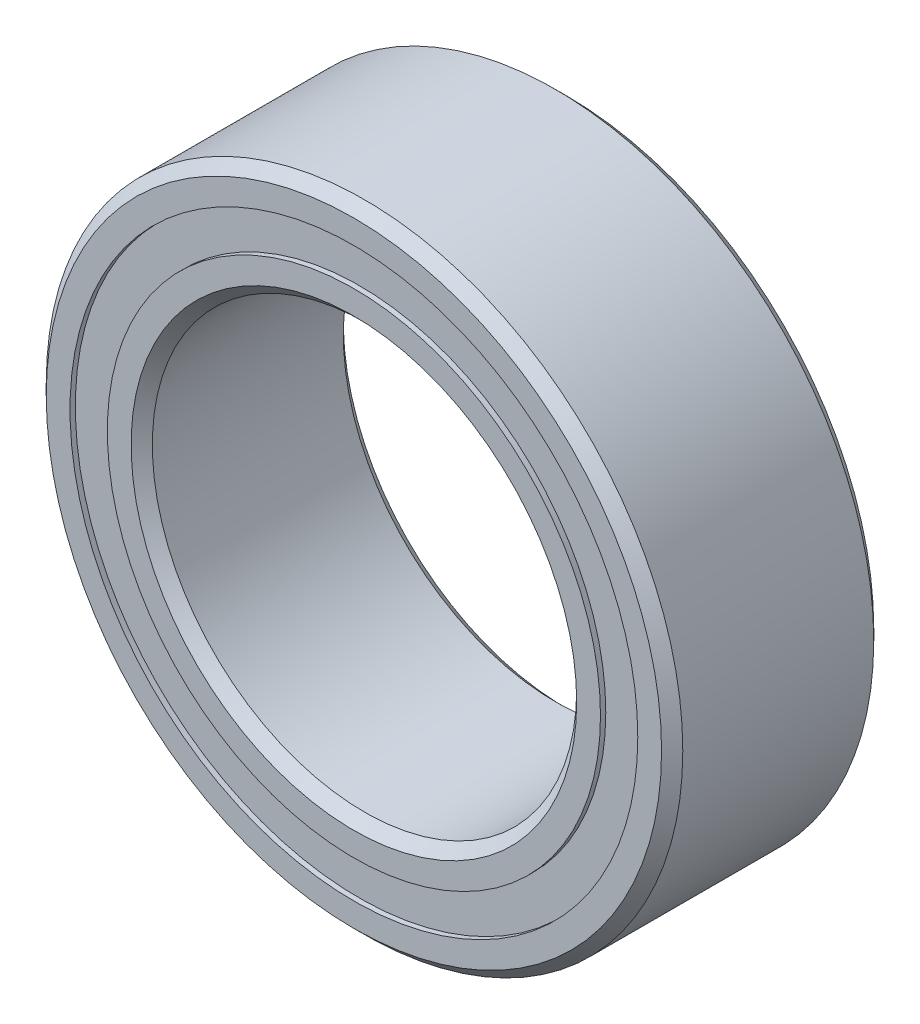
ISO-10303-21;
HEADER;
FILE_DESCRIPTION(('STEP AP214'),'2;1');
FILE_NAME('part.step','',(''),(''),'','','');
FILE_SCHEMA(('AUTOMOTIVE_DESIGN { 1 0 10303 214 1 1 1 1 }'));
ENDSEC;
DATA;
#1=APPLICATION_CONTEXT('core data for automotive mechanical design processes');
#2=APPLICATION_PROTOCOL_DEFINITION('international standard','automotive_design',2000,#1);
#3=PRODUCT_CONTEXT('',#1,'mechanical');
#4=PRODUCT('Part','Part','',(#3));
#5=PRODUCT_RELATED_PRODUCT_CATEGORY('part','',(#4));
#6=PRODUCT_DEFINITION_FORMATION('','',#4);
#7=PRODUCT_DEFINITION_CONTEXT('part definition',#1,'design');
#8=PRODUCT_DEFINITION('design','',#6,#7);
#9=PRODUCT_DEFINITION_SHAPE('','',#8);
#10=(LENGTH_UNIT() NAMED_UNIT(*) SI_UNIT(.MILLI.,.METRE.));
#11=(NAMED_UNIT(*) PLANE_ANGLE_UNIT() SI_UNIT($,.RADIAN.));
#12=(NAMED_UNIT(*) SI_UNIT($,.STERADIAN.) SOLID_ANGLE_UNIT());
#13=UNCERTAINTY_MEASURE_WITH_UNIT(LENGTH_MEASURE(1.E-05),#10,'distance_accuracy_value','');
#14=(GEOMETRIC_REPRESENTATION_CONTEXT(3) GLOBAL_UNCERTAINTY_ASSIGNED_CONTEXT((#13)) GLOBAL_UNIT_ASSIGNED_CONTEXT((#10,
#11,#12)) REPRESENTATION_CONTEXT('',''));
#15=CARTESIAN_POINT('',(0.,0.,0.));
#16=DIRECTION('',(0.,0.,1.));
#17=DIRECTION('',(1.,0.,0.));
#18=AXIS2_PLACEMENT_3D('',#15,#16,#17);
#19=CARTESIAN_POINT('',(0.,4.24787087912088,-1.508125));
#20=DIRECTION('',(0.,0.,1.));
#21=DIRECTION('',(1.,0.,0.));
#22=AXIS2_PLACEMENT_3D('',#19,#20,#21);
#23=PLANE('',#22);
#24=CARTESIAN_POINT('',(0.,0.,-1.508125));
#25=DIRECTION('',(0.,0.,1.));
#26=DIRECTION('',(1.,0.,0.));
#27=AXIS2_PLACEMENT_3D('',#24,#25,#26);
#28=CIRCLE('',#27,3.68962912087912);
#29=CARTESIAN_POINT('',(3.68962912087912,0.,-1.508125));
#30=VERTEX_POINT('',#29);
#31=EDGE_CURVE('P0_E18',#30,#30,#28,.T.);
#32=ORIENTED_EDGE('',*,*,#31,.T.);
#33=EDGE_LOOP('',(#32));
#34=FACE_BOUND('',#33,.T.);
#35=CARTESIAN_POINT('',(0.,0.,-1.508125));
#36=DIRECTION('',(0.,0.,1.));
#37=DIRECTION('',(1.,0.,0.));
#38=AXIS2_PLACEMENT_3D('',#35,#36,#37);
#39=CIRCLE('',#38,4.24787087912088);
#40=CARTESIAN_POINT('',(4.24787087912088,0.,-1.508125));
#41=VERTEX_POINT('',#40);
#42=EDGE_CURVE('P0_E27',#41,#41,#39,.T.);
#43=ORIENTED_EDGE('',*,*,#42,.F.);
#44=EDGE_LOOP('',(#43));
#45=FACE_BOUND('',#44,.T.);
#46=ADVANCED_FACE('P0_F15',(#34,#45),#23,.F.);
#47=CARTESIAN_POINT('',(0.,0.,1.5875));
#48=DIRECTION('',(0.,0.,1.));
#49=DIRECTION('',(1.,0.,0.));
#50=AXIS2_PLACEMENT_3D('',#47,#48,#49);
#51=CYLINDRICAL_SURFACE('',#50,3.68962912087912);
#52=ORIENTED_EDGE('',*,*,#31,.F.);
#53=EDGE_LOOP('',(#52));
#54=FACE_BOUND('',#53,.T.);
#55=CARTESIAN_POINT('',(0.,0.,-0.758760243513405));
#56=DIRECTION('',(0.,0.,1.));
#57=DIRECTION('',(1.,0.,0.));
#58=AXIS2_PLACEMENT_3D('',#55,#56,#57);
#59=CIRCLE('',#58,3.68962912087912);
#60=CARTESIAN_POINT('',(3.68962912087912,0.,-0.758760243513405));
#61=VERTEX_POINT('',#60);
#62=EDGE_CURVE('P0_E22',#61,#61,#59,.T.);
#63=ORIENTED_EDGE('',*,*,#62,.T.);
#64=EDGE_LOOP('',(#63));
#65=FACE_BOUND('',#64,.T.);
#66=ADVANCED_FACE('P0_F37',(#54,#65),#51,.F.);
#67=CARTESIAN_POINT('',(0.,0.,1.5875));
#68=DIRECTION('',(0.,0.,1.));
#69=DIRECTION('',(1.,0.,0.));
#70=AXIS2_PLACEMENT_3D('',#67,#68,#69);
#71=CYLINDRICAL_SURFACE('',#70,4.24787087912088);
#72=CARTESIAN_POINT('',(0.,0.,-0.758760243513404));
#73=DIRECTION('',(0.,0.,1.));
#74=DIRECTION('',(1.,0.,0.));
#75=AXIS2_PLACEMENT_3D('',#72,#73,#74);
#76=CIRCLE('',#75,4.24787087912088);
#77=CARTESIAN_POINT('',(4.24787087912088,0.,-0.758760243513404));
#78=VERTEX_POINT('',#77);
#79=EDGE_CURVE('P0_E10',#78,#78,#76,.F.);
#80=ORIENTED_EDGE('',*,*,#79,.T.);
#81=EDGE_LOOP('',(#80));
#82=FACE_BOUND('',#81,.T.);
#83=ORIENTED_EDGE('',*,*,#42,.T.);
#84=EDGE_LOOP('',(#83));
#85=FACE_BOUND('',#84,.T.);
#86=ADVANCED_FACE('P0_F40',(#82,#85),#71,.T.);
#87=CARTESIAN_POINT('',(0.,4.24787087912088,-0.758760243513404));
#88=DIRECTION('',(0.,0.,-1.));
#89=DIRECTION('',(-1.,0.,0.));
#90=AXIS2_PLACEMENT_3D('',#87,#88,#89);
#91=PLANE('',#90);
#92=ORIENTED_EDGE('',*,*,#79,.F.);
#93=EDGE_LOOP('',(#92));
#94=FACE_BOUND('',#93,.T.);
#95=ORIENTED_EDGE('',*,*,#62,.F.);
#96=EDGE_LOOP('',(#95));
#97=FACE_BOUND('',#96,.T.);
#98=ADVANCED_FACE('P0_F43',(#94,#97),#91,.F.);
#99=CLOSED_SHELL('',(#46,#66,#86,#98));
#100=MANIFOLD_SOLID_BREP('P0_B1',#99);
#101=CARTESIAN_POINT('',(-3.43703832126947,1.98437500000004,0.));
#102=DIRECTION('',(-0.866025403784433,0.50000000000001,0.));
#103=DIRECTION('',(0.,0.,-1.));
#104=AXIS2_PLACEMENT_3D('',#101,#102,#103);
#105=SPHERICAL_SURFACE('',#104,0.758760243513404);
#106=CARTESIAN_POINT('',(-2.7799326750052,1.60499487824333,0.));
#107=VERTEX_POINT('',#106);
#108=VERTEX_LOOP('',#107);
#109=FACE_BOUND('',#108,.T.);
#110=CARTESIAN_POINT('',(-4.09414396753374,2.36375512175675,0.));
#111=VERTEX_POINT('',#110);
#112=VERTEX_LOOP('',#111);
#113=FACE_BOUND('',#112,.T.);
#114=ADVANCED_FACE('P1_F16',(#109,#113),#105,.T.);
#115=CLOSED_SHELL('',(#114));
#116=MANIFOLD_SOLID_BREP('P1_B1',#115);
#117=CARTESIAN_POINT('',(3.43703832126948,-1.98437500000002,0.));
#118=DIRECTION('',(0.866025403784437,-0.500000000000004,0.));
#119=DIRECTION('',(0.,0.,-1.));
#120=AXIS2_PLACEMENT_3D('',#117,#118,#119);
#121=SPHERICAL_SURFACE('',#120,0.758760243513404);
#122=CARTESIAN_POINT('',(4.09414396753376,-2.36375512175672,0.));
#123=VERTEX_POINT('',#122);
#124=VERTEX_LOOP('',#123);
#125=FACE_BOUND('',#124,.T.);
#126=CARTESIAN_POINT('',(2.77993267500521,-1.60499487824331,0.));
#127=VERTEX_POINT('',#126);
#128=VERTEX_LOOP('',#127);
#129=FACE_BOUND('',#128,.T.);
#130=ADVANCED_FACE('P2_F16',(#125,#129),#121,.T.);
#131=CLOSED_SHELL('',(#130));
#132=MANIFOLD_SOLID_BREP('P2_B1',#131);
#133=CARTESIAN_POINT('',(1.984375,3.43703832126949,0.));
#134=DIRECTION('',(0.500000000000001,0.866025403784438,0.));
#135=DIRECTION('',(0.,0.,-1.));
#136=AXIS2_PLACEMENT_3D('',#133,#134,#135);
#137=SPHERICAL_SURFACE('',#136,0.758760243513404);
#138=CARTESIAN_POINT('',(2.36375512175671,4.09414396753376,0.));
#139=VERTEX_POINT('',#138);
#140=VERTEX_LOOP('',#139);
#141=FACE_BOUND('',#140,.T.);
#142=CARTESIAN_POINT('',(1.6049948782433,2.77993267500521,0.));
#143=VERTEX_POINT('',#142);
#144=VERTEX_LOOP('',#143);
#145=FACE_BOUND('',#144,.T.);
#146=ADVANCED_FACE('P3_F16',(#141,#145),#137,.T.);
#147=CLOSED_SHELL('',(#146));
#148=MANIFOLD_SOLID_BREP('P3_B1',#147);
#149=CARTESIAN_POINT('',(0.,-3.96875,0.));
#150=DIRECTION('',(0.,-1.,0.));
#151=DIRECTION('',(0.,0.,-1.));
#152=AXIS2_PLACEMENT_3D('',#149,#150,#151);
#153=SPHERICAL_SURFACE('',#152,0.758760243513404);
#154=CARTESIAN_POINT('',(0.,-3.2099897564866,0.));
#155=VERTEX_POINT('',#154);
#156=VERTEX_LOOP('',#155);
#157=FACE_BOUND('',#156,.T.);
#158=CARTESIAN_POINT('',(0.,-4.7275102435134,0.));
#159=VERTEX_POINT('',#158);
#160=VERTEX_LOOP('',#159);
#161=FACE_BOUND('',#160,.T.);
#162=ADVANCED_FACE('P4_F16',(#157,#161),#153,.T.);
#163=CLOSED_SHELL('',(#162));
#164=MANIFOLD_SOLID_BREP('P4_B1',#163);
#165=CARTESIAN_POINT('',(0.,0.,0.));
#166=DIRECTION('',(0.,0.,1.));
#167=DIRECTION('',(1.,0.,0.));
#168=AXIS2_PLACEMENT_3D('',#165,#166,#167);
#169=TOROIDAL_SURFACE('',#168,3.96875,0.758760243513403);
#170=CARTESIAN_POINT('',(0.,0.,0.705555555555556));
#171=DIRECTION('',(0.,0.,1.));
#172=DIRECTION('',(1.,0.,0.));
#173=AXIS2_PLACEMENT_3D('',#170,#171,#172);
#174=CIRCLE('',#173,3.68962912087912);
#175=CARTESIAN_POINT('',(3.68962912087912,0.,0.705555555555556));
#176=VERTEX_POINT('',#175);
#177=EDGE_CURVE('P5_E33',#176,#176,#174,.T.);
#178=ORIENTED_EDGE('',*,*,#177,.F.);
#179=EDGE_LOOP('',(#178));
#180=FACE_BOUND('',#179,.T.);
#181=CARTESIAN_POINT('',(0.,0.,-0.705555555555556));
#182=DIRECTION('',(0.,0.,1.));
#183=DIRECTION('',(1.,0.,0.));
#184=AXIS2_PLACEMENT_3D('',#181,#182,#183);
#185=CIRCLE('',#184,3.68962912087912);
#186=CARTESIAN_POINT('',(3.68962912087912,0.,-0.705555555555556));
#187=VERTEX_POINT('',#186);
#188=EDGE_CURVE('P5_E31',#187,#187,#185,.F.);
#189=ORIENTED_EDGE('',*,*,#188,.F.);
#190=EDGE_LOOP('',(#189));
#191=FACE_BOUND('',#190,.T.);
#192=ADVANCED_FACE('P5_F15',(#180,#191),#169,.F.);
#193=CARTESIAN_POINT('',(0.,0.,1.5875));
#194=DIRECTION('',(0.,0.,1.));
#195=DIRECTION('',(1.,0.,0.));
#196=AXIS2_PLACEMENT_3D('',#193,#194,#195);
#197=CYLINDRICAL_SURFACE('',#196,3.68962912087912);
#198=CARTESIAN_POINT('',(0.,0.,1.5875));
#199=DIRECTION('',(0.,0.,1.));
#200=DIRECTION('',(1.,0.,0.));
#201=AXIS2_PLACEMENT_3D('',#198,#199,#200);
#202=CIRCLE('',#201,3.68962912087912);
#203=CARTESIAN_POINT('',(3.68962912087912,0.,1.5875));
#204=VERTEX_POINT('',#203);
#205=EDGE_CURVE('P5_E19',#204,#204,#202,.F.);
#206=ORIENTED_EDGE('',*,*,#205,.T.);
#207=EDGE_LOOP('',(#206));
#208=FACE_BOUND('',#207,.T.);
#209=ORIENTED_EDGE('',*,*,#177,.T.);
#210=EDGE_LOOP('',(#209));
#211=FACE_BOUND('',#210,.T.);
#212=ADVANCED_FACE('P5_F49',(#208,#211),#197,.T.);
#213=CARTESIAN_POINT('',(0.,0.,1.5875));
#214=DIRECTION('',(0.,0.,1.));
#215=DIRECTION('',(1.,0.,0.));
#216=AXIS2_PLACEMENT_3D('',#213,#214,#215);
#217=CYLINDRICAL_SURFACE('',#216,3.68962912087912);
#218=ORIENTED_EDGE('',*,*,#188,.T.);
#219=EDGE_LOOP('',(#218));
#220=FACE_BOUND('',#219,.T.);
#221=CARTESIAN_POINT('',(0.,0.,-1.5875));
#222=DIRECTION('',(0.,0.,1.));
#223=DIRECTION('',(1.,0.,0.));
#224=AXIS2_PLACEMENT_3D('',#221,#222,#223);
#225=CIRCLE('',#224,3.68962912087912);
#226=CARTESIAN_POINT('',(3.68962912087912,0.,-1.5875));
#227=VERTEX_POINT('',#226);
#228=EDGE_CURVE('P5_E42',#227,#227,#225,.T.);
#229=ORIENTED_EDGE('',*,*,#228,.T.);
#230=EDGE_LOOP('',(#229));
#231=FACE_BOUND('',#230,.T.);
#232=ADVANCED_FACE('P5_F56',(#220,#231),#217,.T.);
#233=CARTESIAN_POINT('',(0.,3.68962912087912,1.5875));
#234=DIRECTION('',(0.,0.,-1.));
#235=DIRECTION('',(-1.,0.,0.));
#236=AXIS2_PLACEMENT_3D('',#233,#234,#235);
#237=PLANE('',#236);
#238=ORIENTED_EDGE('',*,*,#205,.F.);
#239=EDGE_LOOP('',(#238));
#240=FACE_BOUND('',#239,.T.);
#241=CARTESIAN_POINT('',(0.,0.,1.58749999997099));
#242=DIRECTION('',(0.,0.,1.));
#243=DIRECTION('',(1.,0.,0.));
#244=AXIS2_PLACEMENT_3D('',#241,#242,#243);
#245=CIRCLE('',#244,3.33374999996749);
#246=CARTESIAN_POINT('',(3.33374999996749,0.,1.58749999997099));
#247=VERTEX_POINT('',#246);
#248=EDGE_CURVE('P5_E40',#247,#247,#245,.F.);
#249=ORIENTED_EDGE('',*,*,#248,.T.);
#250=EDGE_LOOP('',(#249));
#251=FACE_BOUND('',#250,.T.);
#252=ADVANCED_FACE('P5_F52',(#240,#251),#237,.F.);
#253=CARTESIAN_POINT('',(0.,3.33375,-1.5875));
#254=DIRECTION('',(0.,0.,1.));
#255=DIRECTION('',(1.,0.,0.));
#256=AXIS2_PLACEMENT_3D('',#253,#254,#255);
#257=PLANE('',#256);
#258=CARTESIAN_POINT('',(0.,0.,-1.58749999997099));
#259=DIRECTION('',(0.,0.,-1.));
#260=DIRECTION('',(0.,1.,0.));
#261=AXIS2_PLACEMENT_3D('',#258,#259,#260);
#262=CIRCLE('',#261,3.33375000002434);
#263=CARTESIAN_POINT('',(0.,3.33375000002434,-1.58749999997099));
#264=VERTEX_POINT('',#263);
#265=EDGE_CURVE('P5_E28',#264,#264,#262,.F.);
#266=ORIENTED_EDGE('',*,*,#265,.T.);
#267=EDGE_LOOP('',(#266));
#268=FACE_BOUND('',#267,.T.);
#269=ORIENTED_EDGE('',*,*,#228,.F.);
#270=EDGE_LOOP('',(#269));
#271=FACE_BOUND('',#270,.T.);
#272=ADVANCED_FACE('P5_F55',(#268,#271),#257,.F.);
#273=CARTESIAN_POINT('',(0.,0.,1.58749999991414));
#274=DIRECTION('',(0.,0.,1.));
#275=DIRECTION('',(1.,0.,0.));
#276=AXIS2_PLACEMENT_3D('',#273,#274,#275);
#277=CONICAL_SURFACE('',#276,3.33374999991065,0.785398163397448);
#278=ORIENTED_EDGE('',*,*,#248,.F.);
#279=EDGE_LOOP('',(#278));
#280=FACE_BOUND('',#279,.T.);
#281=CARTESIAN_POINT('',(0.,0.,1.42875));
#282=DIRECTION('',(0.,0.,1.));
#283=DIRECTION('',(1.,0.,0.));
#284=AXIS2_PLACEMENT_3D('',#281,#282,#283);
#285=CIRCLE('',#284,3.175);
#286=CARTESIAN_POINT('',(3.175,0.,1.42875));
#287=VERTEX_POINT('',#286);
#288=EDGE_CURVE('P5_E23',#287,#287,#285,.F.);
#289=ORIENTED_EDGE('',*,*,#288,.T.);
#290=EDGE_LOOP('',(#289));
#291=FACE_BOUND('',#290,.T.);
#292=ADVANCED_FACE('P5_F60',(#280,#291),#277,.F.);
#293=CARTESIAN_POINT('',(0.,0.,-1.58749999997099));
#294=DIRECTION('',(0.,0.,-1.));
#295=DIRECTION('',(0.,1.,0.));
#296=AXIS2_PLACEMENT_3D('',#293,#294,#295);
#297=CONICAL_SURFACE('',#296,3.33375000002434,0.785398163397448);
#298=CARTESIAN_POINT('',(0.,0.,-1.42875));
#299=DIRECTION('',(0.,0.,1.));
#300=DIRECTION('',(1.,0.,0.));
#301=AXIS2_PLACEMENT_3D('',#298,#299,#300);
#302=CIRCLE('',#301,3.175);
#303=CARTESIAN_POINT('',(3.175,0.,-1.42875));
#304=VERTEX_POINT('',#303);
#305=EDGE_CURVE('P5_E10',#304,#304,#302,.T.);
#306=ORIENTED_EDGE('',*,*,#305,.T.);
#307=EDGE_LOOP('',(#306));
#308=FACE_BOUND('',#307,.T.);
#309=ORIENTED_EDGE('',*,*,#265,.F.);
#310=EDGE_LOOP('',(#309));
#311=FACE_BOUND('',#310,.T.);
#312=ADVANCED_FACE('P5_F63',(#308,#311),#297,.F.);
#313=CARTESIAN_POINT('',(0.,0.,1.5875));
#314=DIRECTION('',(0.,0.,1.));
#315=DIRECTION('',(1.,0.,0.));
#316=AXIS2_PLACEMENT_3D('',#313,#314,#315);
#317=CYLINDRICAL_SURFACE('',#316,3.175);
#318=ORIENTED_EDGE('',*,*,#288,.F.);
#319=EDGE_LOOP('',(#318));
#320=FACE_BOUND('',#319,.T.);
#321=ORIENTED_EDGE('',*,*,#305,.F.);
#322=EDGE_LOOP('',(#321));
#323=FACE_BOUND('',#322,.T.);
#324=ADVANCED_FACE('P5_F67',(#320,#323),#317,.F.);
#325=CLOSED_SHELL('',(#192,#212,#232,#252,#272,#292,#312,#324));
#326=MANIFOLD_SOLID_BREP('P5_B1',#325);
#327=CARTESIAN_POINT('',(0.,3.96875,0.));
#328=DIRECTION('',(0.,1.,0.));
#329=DIRECTION('',(0.,0.,-1.));
#330=AXIS2_PLACEMENT_3D('',#327,#328,#329);
#331=SPHERICAL_SURFACE('',#330,0.758760243513404);
#332=CARTESIAN_POINT('',(0.,3.2099897564866,0.));
#333=VERTEX_POINT('',#332);
#334=VERTEX_LOOP('',#333);
#335=FACE_BOUND('',#334,.T.);
#336=CARTESIAN_POINT('',(0.,4.7275102435134,0.));
#337=VERTEX_POINT('',#336);
#338=VERTEX_LOOP('',#337);
#339=FACE_BOUND('',#338,.T.);
#340=ADVANCED_FACE('P6_F16',(#335,#339),#331,.T.);
#341=CLOSED_SHELL('',(#340));
#342=MANIFOLD_SOLID_BREP('P6_B1',#341);
#343=CARTESIAN_POINT('',(1.98437499999998,-3.4370383212695,0.));
#344=DIRECTION('',(0.499999999999995,-0.866025403784442,0.));
#345=DIRECTION('',(0.,0.,-1.));
#346=AXIS2_PLACEMENT_3D('',#343,#344,#345);
#347=SPHERICAL_SURFACE('',#346,0.758760243513404);
#348=CARTESIAN_POINT('',(2.36375512175668,-4.09414396753378,0.));
#349=VERTEX_POINT('',#348);
#350=VERTEX_LOOP('',#349);
#351=FACE_BOUND('',#350,.T.);
#352=CARTESIAN_POINT('',(1.60499487824328,-2.77993267500523,0.));
#353=VERTEX_POINT('',#352);
#354=VERTEX_LOOP('',#353);
#355=FACE_BOUND('',#354,.T.);
#356=ADVANCED_FACE('P7_F16',(#351,#355),#347,.T.);
#357=CLOSED_SHELL('',(#356));
#358=MANIFOLD_SOLID_BREP('P7_B1',#357);
#359=CARTESIAN_POINT('',(-1.98437500000003,-3.43703832126947,0.));
#360=DIRECTION('',(-0.500000000000007,-0.866025403784435,0.));
#361=DIRECTION('',(0.,0.,-1.));
#362=AXIS2_PLACEMENT_3D('',#359,#360,#361);
#363=SPHERICAL_SURFACE('',#362,0.758760243513404);
#364=CARTESIAN_POINT('',(-1.60499487824332,-2.7799326750052,0.));
#365=VERTEX_POINT('',#364);
#366=VERTEX_LOOP('',#365);
#367=FACE_BOUND('',#366,.T.);
#368=CARTESIAN_POINT('',(-2.36375512175674,-4.09414396753375,0.));
#369=VERTEX_POINT('',#368);
#370=VERTEX_LOOP('',#369);
#371=FACE_BOUND('',#370,.T.);
#372=ADVANCED_FACE('P8_F16',(#367,#371),#363,.T.);
#373=CLOSED_SHELL('',(#372));
#374=MANIFOLD_SOLID_BREP('P8_B1',#373);
#375=CARTESIAN_POINT('',(-3.43703832126951,-1.98437499999997,0.));
#376=DIRECTION('',(-0.866025403784443,-0.499999999999992,0.));
#377=DIRECTION('',(0.,0.,-1.));
#378=AXIS2_PLACEMENT_3D('',#375,#376,#377);
#379=SPHERICAL_SURFACE('',#378,0.758760243513404);
#380=CARTESIAN_POINT('',(-4.09414396753379,-2.36375512175666,0.));
#381=VERTEX_POINT('',#380);
#382=VERTEX_LOOP('',#381);
#383=FACE_BOUND('',#382,.T.);
#384=CARTESIAN_POINT('',(-2.77993267500523,-1.60499487824327,0.));
#385=VERTEX_POINT('',#384);
#386=VERTEX_LOOP('',#385);
#387=FACE_BOUND('',#386,.T.);
#388=ADVANCED_FACE('P9_F16',(#383,#387),#379,.T.);
#389=CLOSED_SHELL('',(#388));
#390=MANIFOLD_SOLID_BREP('P9_B1',#389);
#391=CARTESIAN_POINT('',(-1.98437499999996,3.43703832126952,0.));
#392=DIRECTION('',(-0.499999999999989,0.866025403784445,0.));
#393=DIRECTION('',(0.,0.,-1.));
#394=AXIS2_PLACEMENT_3D('',#391,#392,#393);
#395=SPHERICAL_SURFACE('',#394,0.758760243513404);
#396=CARTESIAN_POINT('',(-2.36375512175665,4.0941439675338,0.));
#397=VERTEX_POINT('',#396);
#398=VERTEX_LOOP('',#397);
#399=FACE_BOUND('',#398,.T.);
#400=CARTESIAN_POINT('',(-1.60499487824326,2.77993267500524,0.));
#401=VERTEX_POINT('',#400);
#402=VERTEX_LOOP('',#401);
#403=FACE_BOUND('',#402,.T.);
#404=ADVANCED_FACE('P10_F16',(#399,#403),#395,.T.);
#405=CLOSED_SHELL('',(#404));
#406=MANIFOLD_SOLID_BREP('P10_B1',#405);
#407=CARTESIAN_POINT('',(3.4370383212695,1.98437499999999,0.));
#408=DIRECTION('',(0.86602540378444,0.499999999999998,0.));
#409=DIRECTION('',(0.,0.,-1.));
#410=AXIS2_PLACEMENT_3D('',#407,#408,#409);
#411=SPHERICAL_SURFACE('',#410,0.758760243513404);
#412=CARTESIAN_POINT('',(4.09414396753377,2.36375512175669,0.));
#413=VERTEX_POINT('',#412);
#414=VERTEX_LOOP('',#413);
#415=FACE_BOUND('',#414,.T.);
#416=CARTESIAN_POINT('',(2.77993267500522,1.60499487824329,0.));
#417=VERTEX_POINT('',#416);
#418=VERTEX_LOOP('',#417);
#419=FACE_BOUND('',#418,.T.);
#420=ADVANCED_FACE('P11_F16',(#415,#419),#411,.T.);
#421=CLOSED_SHELL('',(#420));
#422=MANIFOLD_SOLID_BREP('P11_B1',#421);
#423=CARTESIAN_POINT('',(-3.96875,0.,0.));
#424=DIRECTION('',(-1.,0.,0.));
#425=DIRECTION('',(0.,0.,-1.));
#426=AXIS2_PLACEMENT_3D('',#423,#424,#425);
#427=SPHERICAL_SURFACE('',#426,0.758760243513404);
#428=CARTESIAN_POINT('',(-4.7275102435134,0.,0.));
#429=VERTEX_POINT('',#428);
#430=VERTEX_LOOP('',#429);
#431=FACE_BOUND('',#430,.T.);
#432=CARTESIAN_POINT('',(-3.2099897564866,0.,0.));
#433=VERTEX_POINT('',#432);
#434=VERTEX_LOOP('',#433);
#435=FACE_BOUND('',#434,.T.);
#436=ADVANCED_FACE('P12_F16',(#431,#435),#427,.T.);
#437=CLOSED_SHELL('',(#436));
#438=MANIFOLD_SOLID_BREP('P12_B1',#437);
#439=CARTESIAN_POINT('',(3.96875,0.,0.));
#440=DIRECTION('',(1.,0.,0.));
#441=DIRECTION('',(0.,0.,-1.));
#442=AXIS2_PLACEMENT_3D('',#439,#440,#441);
#443=SPHERICAL_SURFACE('',#442,0.758760243513404);
#444=CARTESIAN_POINT('',(3.2099897564866,0.,0.));
#445=VERTEX_POINT('',#444);
#446=VERTEX_LOOP('',#445);
#447=FACE_BOUND('',#446,.T.);
#448=CARTESIAN_POINT('',(4.7275102435134,0.,0.));
#449=VERTEX_POINT('',#448);
#450=VERTEX_LOOP('',#449);
#451=FACE_BOUND('',#450,.T.);
#452=ADVANCED_FACE('P13_F16',(#447,#451),#443,.T.);
#453=CLOSED_SHELL('',(#452));
#454=MANIFOLD_SOLID_BREP('P13_B1',#453);
#455=CARTESIAN_POINT('',(0.,0.,0.));
#456=DIRECTION('',(0.,0.,1.));
#457=DIRECTION('',(1.,0.,0.));
#458=AXIS2_PLACEMENT_3D('',#455,#456,#457);
#459=TOROIDAL_SURFACE('',#458,3.96875,0.758760243513404);
#460=CARTESIAN_POINT('',(0.,0.,-0.705555555555556));
#461=DIRECTION('',(0.,0.,1.));
#462=DIRECTION('',(1.,0.,0.));
#463=AXIS2_PLACEMENT_3D('',#460,#461,#462);
#464=CIRCLE('',#463,4.24787087912088);
#465=CARTESIAN_POINT('',(4.24787087912088,0.,-0.705555555555556));
#466=VERTEX_POINT('',#465);
#467=EDGE_CURVE('P14_E33',#466,#466,#464,.F.);
#468=ORIENTED_EDGE('',*,*,#467,.T.);
#469=EDGE_LOOP('',(#468));
#470=FACE_BOUND('',#469,.T.);
#471=CARTESIAN_POINT('',(0.,0.,0.705555555555555));
#472=DIRECTION('',(0.,0.,1.));
#473=DIRECTION('',(1.,0.,0.));
#474=AXIS2_PLACEMENT_3D('',#471,#472,#473);
#475=CIRCLE('',#474,4.24787087912088);
#476=CARTESIAN_POINT('',(4.24787087912088,0.,0.705555555555555));
#477=VERTEX_POINT('',#476);
#478=EDGE_CURVE('P14_E31',#477,#477,#475,.T.);
#479=ORIENTED_EDGE('',*,*,#478,.T.);
#480=EDGE_LOOP('',(#479));
#481=FACE_BOUND('',#480,.T.);
#482=ADVANCED_FACE('P14_F15',(#470,#481),#459,.F.);
#483=CARTESIAN_POINT('',(0.,0.,1.5875));
#484=DIRECTION('',(0.,0.,1.));
#485=DIRECTION('',(1.,0.,0.));
#486=AXIS2_PLACEMENT_3D('',#483,#484,#485);
#487=CYLINDRICAL_SURFACE('',#486,4.24787087912088);
#488=CARTESIAN_POINT('',(0.,0.,-1.5875));
#489=DIRECTION('',(0.,0.,1.));
#490=DIRECTION('',(1.,0.,0.));
#491=AXIS2_PLACEMENT_3D('',#488,#489,#490);
#492=CIRCLE('',#491,4.24787087912088);
#493=CARTESIAN_POINT('',(4.24787087912088,0.,-1.5875));
#494=VERTEX_POINT('',#493);
#495=EDGE_CURVE('P14_E19',#494,#494,#492,.F.);
#496=ORIENTED_EDGE('',*,*,#495,.T.);
#497=EDGE_LOOP('',(#496));
#498=FACE_BOUND('',#497,.T.);
#499=ORIENTED_EDGE('',*,*,#467,.F.);
#500=EDGE_LOOP('',(#499));
#501=FACE_BOUND('',#500,.T.);
#502=ADVANCED_FACE('P14_F49',(#498,#501),#487,.F.);
#503=CARTESIAN_POINT('',(0.,0.,1.5875));
#504=DIRECTION('',(0.,0.,1.));
#505=DIRECTION('',(1.,0.,0.));
#506=AXIS2_PLACEMENT_3D('',#503,#504,#505);
#507=CYLINDRICAL_SURFACE('',#506,4.24787087912088);
#508=ORIENTED_EDGE('',*,*,#478,.F.);
#509=EDGE_LOOP('',(#508));
#510=FACE_BOUND('',#509,.T.);
#511=CARTESIAN_POINT('',(0.,0.,1.5875));
#512=DIRECTION('',(0.,0.,1.));
#513=DIRECTION('',(1.,0.,0.));
#514=AXIS2_PLACEMENT_3D('',#511,#512,#513);
#515=CIRCLE('',#514,4.24787087912088);
#516=CARTESIAN_POINT('',(4.24787087912088,0.,1.5875));
#517=VERTEX_POINT('',#516);
#518=EDGE_CURVE('P14_E42',#517,#517,#515,.T.);
#519=ORIENTED_EDGE('',*,*,#518,.T.);
#520=EDGE_LOOP('',(#519));
#521=FACE_BOUND('',#520,.T.);
#522=ADVANCED_FACE('P14_F56',(#510,#521),#507,.F.);
#523=CARTESIAN_POINT('',(0.,4.60375,-1.5875));
#524=DIRECTION('',(0.,0.,1.));
#525=DIRECTION('',(1.,0.,0.));
#526=AXIS2_PLACEMENT_3D('',#523,#524,#525);
#527=PLANE('',#526);
#528=ORIENTED_EDGE('',*,*,#495,.F.);
#529=EDGE_LOOP('',(#528));
#530=FACE_BOUND('',#529,.T.);
#531=CARTESIAN_POINT('',(0.,0.,-1.58750000002783));
#532=DIRECTION('',(0.,0.,1.));
#533=DIRECTION('',(1.,0.,0.));
#534=AXIS2_PLACEMENT_3D('',#531,#532,#533);
#535=CIRCLE('',#534,4.60375000000113);
#536=CARTESIAN_POINT('',(4.60375000000113,0.,-1.58750000002783));
#537=VERTEX_POINT('',#536);
#538=EDGE_CURVE('P14_E40',#537,#537,#535,.T.);
#539=ORIENTED_EDGE('',*,*,#538,.F.);
#540=EDGE_LOOP('',(#539));
#541=FACE_BOUND('',#540,.T.);
#542=ADVANCED_FACE('P14_F52',(#530,#541),#527,.F.);
#543=CARTESIAN_POINT('',(0.,4.60375,1.5875));
#544=DIRECTION('',(0.,0.,-1.));
#545=DIRECTION('',(-1.,0.,0.));
#546=AXIS2_PLACEMENT_3D('',#543,#544,#545);
#547=PLANE('',#546);
#548=CARTESIAN_POINT('',(0.,0.,1.58750000008467));
#549=DIRECTION('',(0.,0.,-1.));
#550=DIRECTION('',(-1.,0.,0.));
#551=AXIS2_PLACEMENT_3D('',#548,#549,#550);
#552=CIRCLE('',#551,4.60375000000113);
#553=CARTESIAN_POINT('',(-4.60375000000113,0.,1.58750000008467));
#554=VERTEX_POINT('',#553);
#555=EDGE_CURVE('P14_E28',#554,#554,#552,.T.);
#556=ORIENTED_EDGE('',*,*,#555,.F.);
#557=EDGE_LOOP('',(#556));
#558=FACE_BOUND('',#557,.T.);
#559=ORIENTED_EDGE('',*,*,#518,.F.);
#560=EDGE_LOOP('',(#559));
#561=FACE_BOUND('',#560,.T.);
#562=ADVANCED_FACE('P14_F55',(#558,#561),#547,.F.);
#563=CARTESIAN_POINT('',(0.,0.,-1.42874999994547));
#564=DIRECTION('',(0.,0.,1.));
#565=DIRECTION('',(1.,0.,0.));
#566=AXIS2_PLACEMENT_3D('',#563,#564,#565);
#567=CONICAL_SURFACE('',#566,4.76250000002665,0.785398163218414);
#568=CARTESIAN_POINT('',(0.,0.,-1.42875));
#569=DIRECTION('',(0.,0.,1.));
#570=DIRECTION('',(1.,0.,0.));
#571=AXIS2_PLACEMENT_3D('',#568,#569,#570);
#572=CIRCLE('',#571,4.7625);
#573=CARTESIAN_POINT('',(4.7625,0.,-1.42875));
#574=VERTEX_POINT('',#573);
#575=EDGE_CURVE('P14_E23',#574,#574,#572,.T.);
#576=ORIENTED_EDGE('',*,*,#575,.F.);
#577=EDGE_LOOP('',(#576));
#578=FACE_BOUND('',#577,.T.);
#579=ORIENTED_EDGE('',*,*,#538,.T.);
#580=EDGE_LOOP('',(#579));
#581=FACE_BOUND('',#580,.T.);
#582=ADVANCED_FACE('P14_F60',(#578,#581),#567,.T.);
#583=CARTESIAN_POINT('',(0.,0.,1.42875000005915));
#584=DIRECTION('',(0.,0.,-1.));
#585=DIRECTION('',(-1.,0.,0.));
#586=AXIS2_PLACEMENT_3D('',#583,#584,#585);
#587=CONICAL_SURFACE('',#586,4.7624999999698,0.785398163218414);
#588=CARTESIAN_POINT('',(0.,0.,1.42875));
#589=DIRECTION('',(0.,0.,1.));
#590=DIRECTION('',(1.,0.,0.));
#591=AXIS2_PLACEMENT_3D('',#588,#589,#590);
#592=CIRCLE('',#591,4.7625);
#593=CARTESIAN_POINT('',(4.7625,0.,1.42875));
#594=VERTEX_POINT('',#593);
#595=EDGE_CURVE('P14_E10',#594,#594,#592,.F.);
#596=ORIENTED_EDGE('',*,*,#595,.F.);
#597=EDGE_LOOP('',(#596));
#598=FACE_BOUND('',#597,.T.);
#599=ORIENTED_EDGE('',*,*,#555,.T.);
#600=EDGE_LOOP('',(#599));
#601=FACE_BOUND('',#600,.T.);
#602=ADVANCED_FACE('P14_F62',(#598,#601),#587,.T.);
#603=CARTESIAN_POINT('',(0.,0.,1.5875));
#604=DIRECTION('',(0.,0.,1.));
#605=DIRECTION('',(1.,0.,0.));
#606=AXIS2_PLACEMENT_3D('',#603,#604,#605);
#607=CYLINDRICAL_SURFACE('',#606,4.7625);
#608=ORIENTED_EDGE('',*,*,#595,.T.);
#609=EDGE_LOOP('',(#608));
#610=FACE_BOUND('',#609,.T.);
#611=ORIENTED_EDGE('',*,*,#575,.T.);
#612=EDGE_LOOP('',(#611));
#613=FACE_BOUND('',#612,.T.);
#614=ADVANCED_FACE('P14_F70',(#610,#613),#607,.T.);
#615=CLOSED_SHELL('',(#482,#502,#522,#542,#562,#582,#602,#614));
#616=MANIFOLD_SOLID_BREP('P14_B1',#615);
#617=CARTESIAN_POINT('',(0.,4.24787087912088,0.758760243513404));
#618=DIRECTION('',(0.,0.,1.));
#619=DIRECTION('',(1.,0.,0.));
#620=AXIS2_PLACEMENT_3D('',#617,#618,#619);
#621=PLANE('',#620);
#622=CARTESIAN_POINT('',(0.,0.,0.758760243513404));
#623=DIRECTION('',(0.,0.,1.));
#624=DIRECTION('',(1.,0.,0.));
#625=AXIS2_PLACEMENT_3D('',#622,#623,#624);
#626=CIRCLE('',#625,3.68962912087912);
#627=CARTESIAN_POINT('',(3.68962912087912,0.,0.758760243513404));
#628=VERTEX_POINT('',#627);
#629=EDGE_CURVE('P15_E18',#628,#628,#626,.T.);
#630=ORIENTED_EDGE('',*,*,#629,.T.);
#631=EDGE_LOOP('',(#630));
#632=FACE_BOUND('',#631,.T.);
#633=CARTESIAN_POINT('',(0.,0.,0.758760243513404));
#634=DIRECTION('',(0.,0.,1.));
#635=DIRECTION('',(1.,0.,0.));
#636=AXIS2_PLACEMENT_3D('',#633,#634,#635);
#637=CIRCLE('',#636,4.24787087912088);
#638=CARTESIAN_POINT('',(4.24787087912088,0.,0.758760243513404));
#639=VERTEX_POINT('',#638);
#640=EDGE_CURVE('P15_E27',#639,#639,#637,.T.);
#641=ORIENTED_EDGE('',*,*,#640,.F.);
#642=EDGE_LOOP('',(#641));
#643=FACE_BOUND('',#642,.T.);
#644=ADVANCED_FACE('P15_F15',(#632,#643),#621,.F.);
#645=CARTESIAN_POINT('',(0.,0.,1.5875));
#646=DIRECTION('',(0.,0.,1.));
#647=DIRECTION('',(1.,0.,0.));
#648=AXIS2_PLACEMENT_3D('',#645,#646,#647);
#649=CYLINDRICAL_SURFACE('',#648,3.68962912087912);
#650=ORIENTED_EDGE('',*,*,#629,.F.);
#651=EDGE_LOOP('',(#650));
#652=FACE_BOUND('',#651,.T.);
#653=CARTESIAN_POINT('',(0.,0.,1.508125));
#654=DIRECTION('',(0.,0.,1.));
#655=DIRECTION('',(1.,0.,0.));
#656=AXIS2_PLACEMENT_3D('',#653,#654,#655);
#657=CIRCLE('',#656,3.68962912087912);
#658=CARTESIAN_POINT('',(3.68962912087912,0.,1.508125));
#659=VERTEX_POINT('',#658);
#660=EDGE_CURVE('P15_E22',#659,#659,#657,.T.);
#661=ORIENTED_EDGE('',*,*,#660,.T.);
#662=EDGE_LOOP('',(#661));
#663=FACE_BOUND('',#662,.T.);
#664=ADVANCED_FACE('P15_F37',(#652,#663),#649,.F.);
#665=CARTESIAN_POINT('',(0.,0.,1.5875));
#666=DIRECTION('',(0.,0.,1.));
#667=DIRECTION('',(1.,0.,0.));
#668=AXIS2_PLACEMENT_3D('',#665,#666,#667);
#669=CYLINDRICAL_SURFACE('',#668,4.24787087912088);
#670=CARTESIAN_POINT('',(0.,0.,1.508125));
#671=DIRECTION('',(0.,0.,1.));
#672=DIRECTION('',(1.,0.,0.));
#673=AXIS2_PLACEMENT_3D('',#670,#671,#672);
#674=CIRCLE('',#673,4.24787087912088);
#675=CARTESIAN_POINT('',(4.24787087912088,0.,1.508125));
#676=VERTEX_POINT('',#675);
#677=EDGE_CURVE('P15_E10',#676,#676,#674,.F.);
#678=ORIENTED_EDGE('',*,*,#677,.T.);
#679=EDGE_LOOP('',(#678));
#680=FACE_BOUND('',#679,.T.);
#681=ORIENTED_EDGE('',*,*,#640,.T.);
#682=EDGE_LOOP('',(#681));
#683=FACE_BOUND('',#682,.T.);
#684=ADVANCED_FACE('P15_F40',(#680,#683),#669,.T.);
#685=CARTESIAN_POINT('',(0.,4.24787087912088,1.508125));
#686=DIRECTION('',(0.,0.,-1.));
#687=DIRECTION('',(-1.,0.,0.));
#688=AXIS2_PLACEMENT_3D('',#685,#686,#687);
#689=PLANE('',#688);
#690=ORIENTED_EDGE('',*,*,#677,.F.);
#691=EDGE_LOOP('',(#690));
#692=FACE_BOUND('',#691,.T.);
#693=ORIENTED_EDGE('',*,*,#660,.F.);
#694=EDGE_LOOP('',(#693));
#695=FACE_BOUND('',#694,.T.);
#696=ADVANCED_FACE('P15_F43',(#692,#695),#689,.F.);
#697=CLOSED_SHELL('',(#644,#664,#684,#696));
#698=MANIFOLD_SOLID_BREP('P15_B1',#697);
#699=ADVANCED_BREP_SHAPE_REPRESENTATION('',(#18,#100,#116,#132,#148,#164,#326,#342,#358,#374,
#390,#406,#422,#438,#454,#616,#698),#14);
#700=SHAPE_DEFINITION_REPRESENTATION(#9,#699);
ENDSEC;
END-ISO-10303-21;
